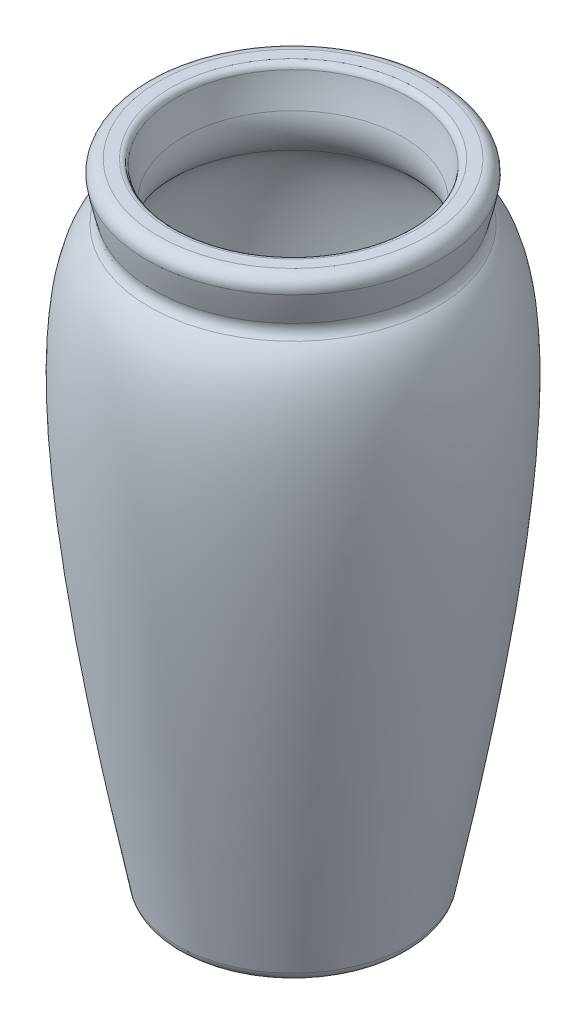
ISO-10303-21;
HEADER;
FILE_DESCRIPTION(('STEP AP214'),'2;1');
FILE_NAME('part.step','',(''),(''),'','','');
FILE_SCHEMA(('AUTOMOTIVE_DESIGN { 1 0 10303 214 1 1 1 1 }'));
ENDSEC;
DATA;
#1=APPLICATION_CONTEXT('core data for automotive mechanical design processes');
#2=APPLICATION_PROTOCOL_DEFINITION('international standard','automotive_design',2000,#1);
#3=PRODUCT_CONTEXT('',#1,'mechanical');
#4=PRODUCT('Part','Part','',(#3));
#5=PRODUCT_RELATED_PRODUCT_CATEGORY('part','',(#4));
#6=PRODUCT_DEFINITION_FORMATION('','',#4);
#7=PRODUCT_DEFINITION_CONTEXT('part definition',#1,'design');
#8=PRODUCT_DEFINITION('design','',#6,#7);
#9=PRODUCT_DEFINITION_SHAPE('','',#8);
#10=(LENGTH_UNIT() NAMED_UNIT(*) SI_UNIT(.MILLI.,.METRE.));
#11=(NAMED_UNIT(*) PLANE_ANGLE_UNIT() SI_UNIT($,.RADIAN.));
#12=(NAMED_UNIT(*) SI_UNIT($,.STERADIAN.) SOLID_ANGLE_UNIT());
#13=UNCERTAINTY_MEASURE_WITH_UNIT(LENGTH_MEASURE(1.E-05),#10,'distance_accuracy_value','');
#14=(GEOMETRIC_REPRESENTATION_CONTEXT(3) GLOBAL_UNCERTAINTY_ASSIGNED_CONTEXT((#13)) GLOBAL_UNIT_ASSIGNED_CONTEXT((#10,
#11,#12)) REPRESENTATION_CONTEXT('',''));
#15=CARTESIAN_POINT('',(0.,0.,0.));
#16=DIRECTION('',(0.,0.,1.));
#17=DIRECTION('',(1.,0.,0.));
#18=AXIS2_PLACEMENT_3D('',#15,#16,#17);
#19=CARTESIAN_POINT('',(-31.2613605199893,132.3,0.));
#20=CARTESIAN_POINT('',(-49.0218900717256,122.95251600101,0.));
#21=CARTESIAN_POINT('',(-34.8116409671177,44.5364407879544,0.));
#22=CARTESIAN_POINT('',(-25.9,0.,0.));
#23=B_SPLINE_CURVE_WITH_KNOTS('',3,(#19,#20,#21,#22),.UNSPECIFIED.,.F.,.F.,(4,4),(0.,1.),.UNSPECIFIED.);
#24=CARTESIAN_POINT('',(0.,144.2,0.));
#25=DIRECTION('',(0.,1.,0.));
#26=AXIS1_PLACEMENT('',#24,#25);
#27=SURFACE_OF_REVOLUTION('',#23,#26);
#28=CARTESIAN_POINT('',(0.,2.25373939128742,0.));
#29=DIRECTION('',(0.,1.,0.));
#30=DIRECTION('',(-1.,0.,0.));
#31=AXIS2_PLACEMENT_3D('',#28,#29,#30);
#32=CIRCLE('',#31,26.3496581090913);
#33=CARTESIAN_POINT('',(-26.3496581090913,2.25373939128742,0.));
#34=VERTEX_POINT('',#33);
#35=EDGE_CURVE('E64',#34,#34,#32,.T.);
#36=ORIENTED_EDGE('',*,*,#35,.T.);
#37=EDGE_LOOP('',(#36));
#38=FACE_BOUND('',#37,.T.);
#39=CARTESIAN_POINT('',(0.,131.336905732425,0.));
#40=DIRECTION('',(0.,1.,0.));
#41=DIRECTION('',(-1.,0.,0.));
#42=AXIS2_PLACEMENT_3D('',#39,#40,#41);
#43=CIRCLE('',#42,32.7003808006313);
#44=CARTESIAN_POINT('',(-32.7003808006314,131.336905732425,0.));
#45=VERTEX_POINT('',#44);
#46=EDGE_CURVE('E67',#45,#45,#43,.F.);
#47=ORIENTED_EDGE('',*,*,#46,.T.);
#48=EDGE_LOOP('',(#47));
#49=FACE_BOUND('',#48,.T.);
#50=ADVANCED_FACE('F32',(#38,#49),#27,.F.);
#51=CARTESIAN_POINT('',(-25.9,0.,0.));
#52=DIRECTION('',(0.,-1.,0.));
#53=DIRECTION('',(1.,0.,0.));
#54=AXIS2_PLACEMENT_3D('',#51,#52,#53);
#55=PLANE('',#54);
#56=CARTESIAN_POINT('',(0.,0.,0.));
#57=DIRECTION('',(0.,-1.,0.));
#58=DIRECTION('',(1.,0.,0.));
#59=AXIS2_PLACEMENT_3D('',#56,#57,#58);
#60=CIRCLE('',#59,23.6034608570045);
#61=CARTESIAN_POINT('',(23.6034608570045,0.,0.));
#62=VERTEX_POINT('',#61);
#63=EDGE_CURVE('E61',#62,#62,#60,.T.);
#64=ORIENTED_EDGE('',*,*,#63,.T.);
#65=EDGE_LOOP('',(#64));
#66=FACE_BOUND('',#65,.T.);
#67=ADVANCED_FACE('F94',(#66),#55,.T.);
#68=CARTESIAN_POINT('',(-33.6,144.2,0.));
#69=DIRECTION('',(0.,1.,0.));
#70=DIRECTION('',(-1.,0.,0.));
#71=AXIS2_PLACEMENT_3D('',#68,#69,#70);
#72=PLANE('',#71);
#73=CARTESIAN_POINT('',(0.,144.2,0.));
#74=DIRECTION('',(0.,1.,0.));
#75=DIRECTION('',(-1.,0.,0.));
#76=AXIS2_PLACEMENT_3D('',#73,#74,#75);
#77=CIRCLE('',#76,27.9536003591184);
#78=CARTESIAN_POINT('',(-27.9536003591184,144.2,0.));
#79=VERTEX_POINT('',#78);
#80=EDGE_CURVE('E10',#79,#79,#77,.F.);
#81=ORIENTED_EDGE('',*,*,#80,.T.);
#82=EDGE_LOOP('',(#81));
#83=FACE_BOUND('',#82,.T.);
#84=CARTESIAN_POINT('',(0.,144.2,0.));
#85=DIRECTION('',(0.,1.,0.));
#86=DIRECTION('',(-1.,0.,0.));
#87=AXIS2_PLACEMENT_3D('',#84,#85,#86);
#88=CIRCLE('',#87,30.5664951092836);
#89=CARTESIAN_POINT('',(-30.5664951092837,144.2,0.));
#90=VERTEX_POINT('',#89);
#91=EDGE_CURVE('E52',#90,#90,#88,.T.);
#92=ORIENTED_EDGE('',*,*,#91,.T.);
#93=EDGE_LOOP('',(#92));
#94=FACE_BOUND('',#93,.T.);
#95=ADVANCED_FACE('F88',(#83,#94),#72,.T.);
#96=CARTESIAN_POINT('',(-33.6,144.2,0.));
#97=CARTESIAN_POINT('',(-33.9123848773817,141.947385967174,0.));
#98=CARTESIAN_POINT('',(-31.2613605199894,132.3,0.));
#99=B_SPLINE_CURVE_WITH_KNOTS('',2,(#96,#97,#98),.UNSPECIFIED.,.F.,.F.,(3,3),(0.,1.),.UNSPECIFIED.);
#100=CARTESIAN_POINT('',(0.,144.2,0.));
#101=DIRECTION('',(0.,1.,0.));
#102=AXIS1_PLACEMENT('',#100,#101);
#103=SURFACE_OF_REVOLUTION('',#99,#102);
#104=CARTESIAN_POINT('',(0.,134.210278358387,0.));
#105=DIRECTION('',(0.,1.,0.));
#106=DIRECTION('',(-1.,0.,0.));
#107=AXIS2_PLACEMENT_3D('',#104,#105,#106);
#108=CIRCLE('',#107,31.7763938651247);
#109=CARTESIAN_POINT('',(-31.7763938651247,134.210278358387,0.));
#110=VERTEX_POINT('',#109);
#111=EDGE_CURVE('E55',#110,#110,#108,.T.);
#112=ORIENTED_EDGE('',*,*,#111,.T.);
#113=EDGE_LOOP('',(#112));
#114=FACE_BOUND('',#113,.T.);
#115=CARTESIAN_POINT('',(0.,140.913141537651,0.));
#116=DIRECTION('',(0.,1.,0.));
#117=DIRECTION('',(-1.,0.,0.));
#118=AXIS2_PLACEMENT_3D('',#115,#116,#117);
#119=CIRCLE('',#118,33.3238432624263);
#120=CARTESIAN_POINT('',(-33.3238432624263,140.913141537651,0.));
#121=VERTEX_POINT('',#120);
#122=EDGE_CURVE('E58',#121,#121,#119,.F.);
#123=ORIENTED_EDGE('',*,*,#122,.T.);
#124=EDGE_LOOP('',(#123));
#125=FACE_BOUND('',#124,.T.);
#126=ADVANCED_FACE('F83',(#114,#125),#103,.F.);
#127=CARTESIAN_POINT('',(0.,2.8,0.));
#128=DIRECTION('',(0.,1.,0.));
#129=DIRECTION('',(-1.,0.,0.));
#130=AXIS2_PLACEMENT_3D('',#127,#128,#129);
#131=TOROIDAL_SURFACE('',#130,23.6034608570045,2.8);
#132=ORIENTED_EDGE('',*,*,#63,.F.);
#133=EDGE_LOOP('',(#132));
#134=FACE_BOUND('',#133,.T.);
#135=ORIENTED_EDGE('',*,*,#35,.F.);
#136=EDGE_LOOP('',(#135));
#137=FACE_BOUND('',#136,.T.);
#138=ADVANCED_FACE('F87',(#134,#137),#131,.T.);
#139=CARTESIAN_POINT('',(0.,133.495598219803,0.));
#140=DIRECTION('',(0.,1.,0.));
#141=DIRECTION('',(-1.,0.,0.));
#142=AXIS2_PLACEMENT_3D('',#139,#140,#141);
#143=TOROIDAL_SURFACE('',#142,34.4836493572262,2.8);
#144=ORIENTED_EDGE('',*,*,#46,.F.);
#145=EDGE_LOOP('',(#144));
#146=FACE_BOUND('',#145,.T.);
#147=ORIENTED_EDGE('',*,*,#111,.F.);
#148=EDGE_LOOP('',(#147));
#149=FACE_BOUND('',#148,.T.);
#150=ADVANCED_FACE('F100',(#146,#149),#143,.F.);
#151=CARTESIAN_POINT('',(0.,141.4,0.));
#152=DIRECTION('',(0.,1.,0.));
#153=DIRECTION('',(-1.,0.,0.));
#154=AXIS2_PLACEMENT_3D('',#151,#152,#153);
#155=TOROIDAL_SURFACE('',#154,30.5664951092836,2.8);
#156=ORIENTED_EDGE('',*,*,#122,.F.);
#157=EDGE_LOOP('',(#156));
#158=FACE_BOUND('',#157,.T.);
#159=ORIENTED_EDGE('',*,*,#91,.F.);
#160=EDGE_LOOP('',(#159));
#161=FACE_BOUND('',#160,.T.);
#162=ADVANCED_FACE('F104',(#158,#161),#155,.T.);
#163=CARTESIAN_POINT('',(-31.2613605199893,132.3,0.));
#164=CARTESIAN_POINT('',(-49.0218900717256,122.95251600101,0.));
#165=CARTESIAN_POINT('',(-34.8116409671177,44.5364407879544,0.));
#166=CARTESIAN_POINT('',(-25.9,0.,0.));
#167=B_SPLINE_CURVE_WITH_KNOTS('',3,(#163,#164,#165,#166),.UNSPECIFIED.,.F.,.F.,(4,4),(0.,1.),.UNSPECIFIED.);
#168=CARTESIAN_POINT('',(0.,144.2,0.));
#169=DIRECTION('',(0.,1.,0.));
#170=AXIS1_PLACEMENT('',#168,#169);
#171=SURFACE_OF_REVOLUTION('',#167,#170);
#172=OFFSET_SURFACE('',#171,7.,.F.);
#173=CARTESIAN_POINT('',(0.,8.13044993846085,0.));
#174=DIRECTION('',(0.,1.,0.));
#175=DIRECTION('',(-1.,0.,0.));
#176=AXIS2_PLACEMENT_3D('',#173,#174,#175);
#177=CIRCLE('',#176,20.3755317379913);
#178=CARTESIAN_POINT('',(-20.3755317379913,8.13044993846085,0.));
#179=VERTEX_POINT('',#178);
#180=EDGE_CURVE('E43',#179,#179,#177,.F.);
#181=ORIENTED_EDGE('',*,*,#180,.T.);
#182=EDGE_LOOP('',(#181));
#183=FACE_BOUND('',#182,.T.);
#184=CARTESIAN_POINT('',(0.,125.940174513982,0.));
#185=DIRECTION('',(0.,1.,0.));
#186=DIRECTION('',(-1.,0.,0.));
#187=AXIS2_PLACEMENT_3D('',#184,#185,#186);
#188=CIRCLE('',#187,28.2422094091442);
#189=CARTESIAN_POINT('',(-28.2422094091442,125.940174513982,0.));
#190=VERTEX_POINT('',#189);
#191=EDGE_CURVE('E141',#190,#190,#188,.F.);
#192=ORIENTED_EDGE('',*,*,#191,.F.);
#193=EDGE_LOOP('',(#192));
#194=FACE_BOUND('',#193,.T.);
#195=ADVANCED_FACE('F107',(#183,#194),#172,.T.);
#196=CARTESIAN_POINT('',(-25.9,7.,0.));
#197=DIRECTION('',(0.,-1.,0.));
#198=DIRECTION('',(1.,0.,0.));
#199=AXIS2_PLACEMENT_3D('',#196,#197,#198);
#200=PLANE('',#199);
#201=CARTESIAN_POINT('',(0.,7.,0.));
#202=DIRECTION('',(0.,-1.,0.));
#203=DIRECTION('',(1.,0.,0.));
#204=AXIS2_PLACEMENT_3D('',#201,#202,#203);
#205=CIRCLE('',#204,19.0017257967011);
#206=CARTESIAN_POINT('',(19.0017257967011,7.,0.));
#207=VERTEX_POINT('',#206);
#208=EDGE_CURVE('E47',#207,#207,#205,.F.);
#209=ORIENTED_EDGE('',*,*,#208,.T.);
#210=EDGE_LOOP('',(#209));
#211=FACE_BOUND('',#210,.T.);
#212=ADVANCED_FACE('F130',(#211),#200,.F.);
#213=CARTESIAN_POINT('',(-33.6407640736916,144.089837265643,0.));
#214=CARTESIAN_POINT('',(-33.6364305616403,143.814509789245,0.));
#215=CARTESIAN_POINT('',(-33.5884910712614,140.768698735838,0.));
#216=CARTESIAN_POINT('',(-31.2613605199894,132.3,0.));
#217=B_SPLINE_CURVE_WITH_KNOTS('',2,(#213,#214,#215,#216),.UNSPECIFIED.,.F.,.F.,(3,1,3),
(0.0349397937582619,0.12217685032474,1.),.UNSPECIFIED.);
#218=CARTESIAN_POINT('',(0.,144.2,0.));
#219=DIRECTION('',(0.,1.,0.));
#220=AXIS1_PLACEMENT('',#218,#219);
#221=SURFACE_OF_REVOLUTION('',#217,#220);
#222=OFFSET_SURFACE('',#221,7.,.F.);
#223=CARTESIAN_POINT('',(0.,142.987992531864,0.));
#224=DIRECTION('',(0.,1.,0.));
#225=DIRECTION('',(-1.,0.,0.));
#226=AXIS2_PLACEMENT_3D('',#223,#224,#225);
#227=CIRCLE('',#226,26.5662796290911);
#228=CARTESIAN_POINT('',(-26.5662796290911,142.987992531864,0.));
#229=VERTEX_POINT('',#228);
#230=EDGE_CURVE('E39',#229,#229,#227,.T.);
#231=ORIENTED_EDGE('',*,*,#230,.T.);
#232=EDGE_LOOP('',(#231));
#233=FACE_BOUND('',#232,.T.);
#234=CARTESIAN_POINT('',(0.,135.996978704847,0.));
#235=DIRECTION('',(0.,1.,0.));
#236=DIRECTION('',(-1.,0.,0.));
#237=AXIS2_PLACEMENT_3D('',#234,#235,#236);
#238=CIRCLE('',#237,25.0082551348711);
#239=CARTESIAN_POINT('',(-25.0082551348711,135.996978704847,0.));
#240=VERTEX_POINT('',#239);
#241=EDGE_CURVE('E70',#240,#240,#238,.T.);
#242=ORIENTED_EDGE('',*,*,#241,.F.);
#243=EDGE_LOOP('',(#242));
#244=FACE_BOUND('',#243,.T.);
#245=ADVANCED_FACE('F117',(#233,#244),#222,.T.);
#246=CARTESIAN_POINT('',(0.,133.495598219803,0.));
#247=DIRECTION('',(0.,1.,0.));
#248=DIRECTION('',(-1.,0.,0.));
#249=AXIS2_PLACEMENT_3D('',#246,#247,#248);
#250=TOROIDAL_SURFACE('',#249,34.4836493572262,9.8);
#251=ORIENTED_EDGE('',*,*,#191,.T.);
#252=EDGE_LOOP('',(#251));
#253=FACE_BOUND('',#252,.T.);
#254=ORIENTED_EDGE('',*,*,#241,.T.);
#255=EDGE_LOOP('',(#254));
#256=FACE_BOUND('',#255,.T.);
#257=ADVANCED_FACE('F90',(#253,#256),#250,.T.);
#258=CARTESIAN_POINT('',(0.,8.40000000000001,0.));
#259=DIRECTION('',(0.,1.,0.));
#260=DIRECTION('',(-1.,0.,0.));
#261=AXIS2_PLACEMENT_3D('',#258,#259,#260);
#262=TOROIDAL_SURFACE('',#261,19.0017257967011,1.4);
#263=ORIENTED_EDGE('',*,*,#180,.F.);
#264=EDGE_LOOP('',(#263));
#265=FACE_BOUND('',#264,.T.);
#266=ORIENTED_EDGE('',*,*,#208,.F.);
#267=EDGE_LOOP('',(#266));
#268=FACE_BOUND('',#267,.T.);
#269=ADVANCED_FACE('F109',(#265,#268),#262,.F.);
#270=CARTESIAN_POINT('',(0.,142.8,0.));
#271=DIRECTION('',(0.,1.,0.));
#272=DIRECTION('',(-1.,0.,0.));
#273=AXIS2_PLACEMENT_3D('',#270,#271,#272);
#274=TOROIDAL_SURFACE('',#273,27.9536003591184,1.4);
#275=ORIENTED_EDGE('',*,*,#80,.F.);
#276=EDGE_LOOP('',(#275));
#277=FACE_BOUND('',#276,.T.);
#278=ORIENTED_EDGE('',*,*,#230,.F.);
#279=EDGE_LOOP('',(#278));
#280=FACE_BOUND('',#279,.T.);
#281=ADVANCED_FACE('F34',(#277,#280),#274,.T.);
#282=CLOSED_SHELL('',(#50,#67,#95,#126,#138,#150,#162,#195,#212,#245,#257,#269,#281));
#283=MANIFOLD_SOLID_BREP('B2',#282);
#284=ADVANCED_BREP_SHAPE_REPRESENTATION('',(#18,#283),#14);
#285=SHAPE_DEFINITION_REPRESENTATION(#9,#284);
ENDSEC;
END-ISO-10303-21;
